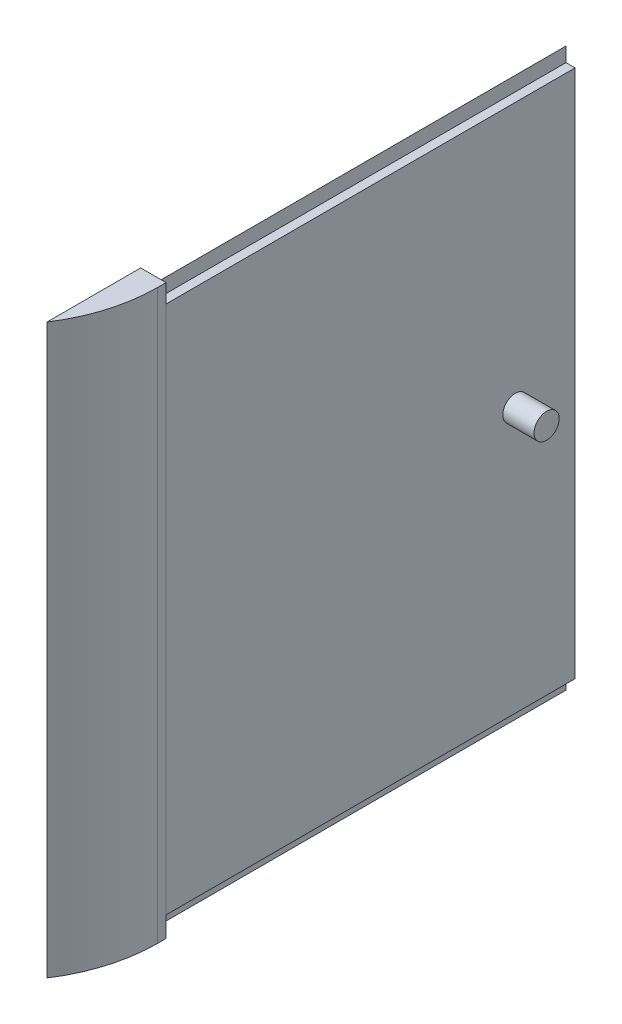
ISO-10303-21;
HEADER;
FILE_DESCRIPTION(('STEP AP214'),'2;1');
FILE_NAME('part.step','',(''),(''),'','','');
FILE_SCHEMA(('AUTOMOTIVE_DESIGN { 1 0 10303 214 1 1 1 1 }'));
ENDSEC;
DATA;
#1=APPLICATION_CONTEXT('core data for automotive mechanical design processes');
#2=APPLICATION_PROTOCOL_DEFINITION('international standard','automotive_design',2000,#1);
#3=PRODUCT_CONTEXT('',#1,'mechanical');
#4=PRODUCT('Part','Part','',(#3));
#5=PRODUCT_RELATED_PRODUCT_CATEGORY('part','',(#4));
#6=PRODUCT_DEFINITION_FORMATION('','',#4);
#7=PRODUCT_DEFINITION_CONTEXT('part definition',#1,'design');
#8=PRODUCT_DEFINITION('design','',#6,#7);
#9=PRODUCT_DEFINITION_SHAPE('','',#8);
#10=(LENGTH_UNIT() NAMED_UNIT(*) SI_UNIT(.MILLI.,.METRE.));
#11=(NAMED_UNIT(*) PLANE_ANGLE_UNIT() SI_UNIT($,.RADIAN.));
#12=(NAMED_UNIT(*) SI_UNIT($,.STERADIAN.) SOLID_ANGLE_UNIT());
#13=UNCERTAINTY_MEASURE_WITH_UNIT(LENGTH_MEASURE(1.E-05),#10,'distance_accuracy_value','');
#14=(GEOMETRIC_REPRESENTATION_CONTEXT(3) GLOBAL_UNCERTAINTY_ASSIGNED_CONTEXT((#13)) GLOBAL_UNIT_ASSIGNED_CONTEXT((#10,
#11,#12)) REPRESENTATION_CONTEXT('',''));
#15=CARTESIAN_POINT('',(0.,0.,0.));
#16=DIRECTION('',(0.,0.,1.));
#17=DIRECTION('',(1.,0.,0.));
#18=AXIS2_PLACEMENT_3D('',#15,#16,#17);
#19=CARTESIAN_POINT('',(37.6840725431511,-12.25,-105.));
#20=DIRECTION('',(0.,1.,0.));
#21=DIRECTION('',(0.,0.,1.));
#22=AXIS2_PLACEMENT_3D('',#19,#20,#21);
#23=PLANE('',#22);
#24=DIRECTION('',(-1.,0.,0.));
#25=VECTOR('',#24,1.);
#26=CARTESIAN_POINT('',(37.6840725431511,-12.25,0.));
#27=LINE('',#26,#25);
#28=CARTESIAN_POINT('',(39.75,-12.25,0.));
#29=VERTEX_POINT('',#28);
#30=CARTESIAN_POINT('',(37.4340725431511,-12.25,0.));
#31=VERTEX_POINT('',#30);
#32=EDGE_CURVE('E166',#29,#31,#27,.T.);
#33=ORIENTED_EDGE('',*,*,#32,.F.);
#34=DIRECTION('',(0.,0.,1.));
#35=VECTOR('',#34,1.);
#36=CARTESIAN_POINT('',(39.75,-12.25,-105.));
#37=LINE('',#36,#35);
#38=CARTESIAN_POINT('',(39.75,-12.25,-105.));
#39=VERTEX_POINT('',#38);
#40=EDGE_CURVE('E209',#39,#29,#37,.T.);
#41=ORIENTED_EDGE('',*,*,#40,.F.);
#42=DIRECTION('',(-1.,0.,0.));
#43=VECTOR('',#42,1.);
#44=CARTESIAN_POINT('',(37.6840725431511,-12.25,-105.));
#45=LINE('',#44,#43);
#46=CARTESIAN_POINT('',(37.4340725431511,-12.25,-105.));
#47=VERTEX_POINT('',#46);
#48=EDGE_CURVE('E182',#39,#47,#45,.T.);
#49=ORIENTED_EDGE('',*,*,#48,.T.);
#50=DIRECTION('',(0.,0.,1.));
#51=VECTOR('',#50,1.);
#52=CARTESIAN_POINT('',(37.4340725431511,-12.25,-105.));
#53=LINE('',#52,#51);
#54=EDGE_CURVE('E128',#47,#31,#53,.T.);
#55=ORIENTED_EDGE('',*,*,#54,.T.);
#56=EDGE_LOOP('',(#33,#41,#49,#55));
#57=FACE_BOUND('',#56,.T.);
#58=ADVANCED_FACE('F39',(#57),#23,.T.);
#59=CARTESIAN_POINT('',(39.75,-12.25,-105.));
#60=DIRECTION('',(1.,0.,0.));
#61=DIRECTION('',(0.,0.,-1.));
#62=AXIS2_PLACEMENT_3D('',#59,#60,#61);
#63=PLANE('',#62);
#64=CARTESIAN_POINT('',(39.75,-80.,-89.7147562589282));
#65=DIRECTION('',(1.,0.,0.));
#66=DIRECTION('',(0.,0.,-1.));
#67=AXIS2_PLACEMENT_3D('',#64,#65,#66);
#68=CIRCLE('',#67,3.21909799375135);
#69=CARTESIAN_POINT('',(39.75,-80.,-92.9338542526796));
#70=VERTEX_POINT('',#69);
#71=EDGE_CURVE('E152',#70,#70,#68,.T.);
#72=ORIENTED_EDGE('',*,*,#71,.F.);
#73=EDGE_LOOP('',(#72));
#74=FACE_BOUND('',#73,.T.);
#75=DIRECTION('',(0.,1.,0.));
#76=VECTOR('',#75,1.);
#77=CARTESIAN_POINT('',(39.75,-12.25,0.));
#78=LINE('',#77,#76);
#79=CARTESIAN_POINT('',(39.75,-147.75,0.));
#80=VERTEX_POINT('',#79);
#81=EDGE_CURVE('E202',#80,#29,#78,.T.);
#82=ORIENTED_EDGE('',*,*,#81,.F.);
#83=DIRECTION('',(0.,0.,1.));
#84=VECTOR('',#83,1.);
#85=CARTESIAN_POINT('',(39.75,-147.75,-105.));
#86=LINE('',#85,#84);
#87=CARTESIAN_POINT('',(39.75,-147.75,-105.));
#88=VERTEX_POINT('',#87);
#89=EDGE_CURVE('E211',#88,#80,#86,.T.);
#90=ORIENTED_EDGE('',*,*,#89,.F.);
#91=DIRECTION('',(0.,1.,0.));
#92=VECTOR('',#91,1.);
#93=CARTESIAN_POINT('',(39.75,-12.25,-105.));
#94=LINE('',#93,#92);
#95=EDGE_CURVE('E179',#88,#39,#94,.T.);
#96=ORIENTED_EDGE('',*,*,#95,.T.);
#97=ORIENTED_EDGE('',*,*,#40,.T.);
#98=EDGE_LOOP('',(#82,#90,#96,#97));
#99=FACE_BOUND('',#98,.T.);
#100=ADVANCED_FACE('F259',(#74,#99),#63,.T.);
#101=CARTESIAN_POINT('',(37.6840725431511,-147.75,-105.));
#102=DIRECTION('',(0.,-1.,0.));
#103=DIRECTION('',(0.,0.,-1.));
#104=AXIS2_PLACEMENT_3D('',#101,#102,#103);
#105=PLANE('',#104);
#106=DIRECTION('',(1.,0.,0.));
#107=VECTOR('',#106,1.);
#108=CARTESIAN_POINT('',(37.6840725431511,-147.75,0.));
#109=LINE('',#108,#107);
#110=CARTESIAN_POINT('',(37.4340725431511,-147.75,0.));
#111=VERTEX_POINT('',#110);
#112=EDGE_CURVE('E199',#111,#80,#109,.T.);
#113=ORIENTED_EDGE('',*,*,#112,.F.);
#114=DIRECTION('',(0.,0.,1.));
#115=VECTOR('',#114,1.);
#116=CARTESIAN_POINT('',(37.4340725431511,-147.75,-105.));
#117=LINE('',#116,#115);
#118=CARTESIAN_POINT('',(37.4340725431511,-147.75,-105.));
#119=VERTEX_POINT('',#118);
#120=EDGE_CURVE('E213',#119,#111,#117,.T.);
#121=ORIENTED_EDGE('',*,*,#120,.F.);
#122=DIRECTION('',(1.,0.,0.));
#123=VECTOR('',#122,1.);
#124=CARTESIAN_POINT('',(37.4340725431511,-147.75,-105.));
#125=LINE('',#124,#123);
#126=EDGE_CURVE('E177',#119,#88,#125,.T.);
#127=ORIENTED_EDGE('',*,*,#126,.T.);
#128=ORIENTED_EDGE('',*,*,#89,.T.);
#129=EDGE_LOOP('',(#113,#121,#127,#128));
#130=FACE_BOUND('',#129,.T.);
#131=ADVANCED_FACE('F257',(#130),#105,.T.);
#132=CARTESIAN_POINT('',(37.4340725431511,-148.,-105.));
#133=DIRECTION('',(1.,0.,0.));
#134=DIRECTION('',(0.,0.,-1.));
#135=AXIS2_PLACEMENT_3D('',#132,#133,#134);
#136=PLANE('',#135);
#137=DIRECTION('',(0.,1.,0.));
#138=VECTOR('',#137,1.);
#139=CARTESIAN_POINT('',(37.4340725431511,-148.,0.));
#140=LINE('',#139,#138);
#141=CARTESIAN_POINT('',(37.4340725431511,-151.441105038332,0.));
#142=VERTEX_POINT('',#141);
#143=EDGE_CURVE('E196',#142,#111,#140,.T.);
#144=ORIENTED_EDGE('',*,*,#143,.F.);
#145=DIRECTION('',(0.,0.,1.));
#146=VECTOR('',#145,1.);
#147=CARTESIAN_POINT('',(37.4340725431511,-151.441105038332,-105.));
#148=LINE('',#147,#146);
#149=CARTESIAN_POINT('',(37.4340725431511,-151.441105038332,-105.));
#150=VERTEX_POINT('',#149);
#151=EDGE_CURVE('E216',#150,#142,#148,.T.);
#152=ORIENTED_EDGE('',*,*,#151,.F.);
#153=DIRECTION('',(0.,1.,0.));
#154=VECTOR('',#153,1.);
#155=CARTESIAN_POINT('',(37.4340725431511,-151.441105038332,-105.));
#156=LINE('',#155,#154);
#157=EDGE_CURVE('E175',#150,#119,#156,.T.);
#158=ORIENTED_EDGE('',*,*,#157,.T.);
#159=ORIENTED_EDGE('',*,*,#120,.T.);
#160=EDGE_LOOP('',(#144,#152,#158,#159));
#161=FACE_BOUND('',#160,.T.);
#162=ADVANCED_FACE('F252',(#161),#136,.T.);
#163=CARTESIAN_POINT('',(33.9340725431511,-147.897355038332,-105.));
#164=DIRECTION('',(-0.711485024799433,-0.702701259061167,0.));
#165=DIRECTION('',(0.702701259061167,-0.711485024799434,0.));
#166=AXIS2_PLACEMENT_3D('',#163,#164,#165);
#167=PLANE('',#166);
#168=DIRECTION('',(0.702701259061167,-0.711485024799434,0.));
#169=VECTOR('',#168,1.);
#170=CARTESIAN_POINT('',(33.9340725431511,-147.897355038332,0.));
#171=LINE('',#170,#169);
#172=CARTESIAN_POINT('',(33.9340725431511,-147.897355038332,0.));
#173=VERTEX_POINT('',#172);
#174=EDGE_CURVE('E193',#173,#142,#171,.T.);
#175=ORIENTED_EDGE('',*,*,#174,.F.);
#176=DIRECTION('',(0.,0.,1.));
#177=VECTOR('',#176,1.);
#178=CARTESIAN_POINT('',(33.9340725431511,-147.897355038332,-105.));
#179=LINE('',#178,#177);
#180=CARTESIAN_POINT('',(33.9340725431511,-147.897355038332,-105.));
#181=VERTEX_POINT('',#180);
#182=EDGE_CURVE('E219',#181,#173,#179,.T.);
#183=ORIENTED_EDGE('',*,*,#182,.F.);
#184=DIRECTION('',(0.702701259061167,-0.711485024799434,0.));
#185=VECTOR('',#184,1.);
#186=CARTESIAN_POINT('',(33.9340725431511,-147.897355038332,-105.));
#187=LINE('',#186,#185);
#188=EDGE_CURVE('E172',#181,#150,#187,.T.);
#189=ORIENTED_EDGE('',*,*,#188,.T.);
#190=ORIENTED_EDGE('',*,*,#151,.T.);
#191=EDGE_LOOP('',(#175,#183,#189,#190));
#192=FACE_BOUND('',#191,.T.);
#193=ADVANCED_FACE('F250',(#192),#167,.T.);
#194=CARTESIAN_POINT('',(33.9340725431511,-12.1026449616677,-105.));
#195=DIRECTION('',(-1.,0.,0.));
#196=DIRECTION('',(0.,0.,1.));
#197=AXIS2_PLACEMENT_3D('',#194,#195,#196);
#198=PLANE('',#197);
#199=DIRECTION('',(0.,-1.,0.));
#200=VECTOR('',#199,1.);
#201=CARTESIAN_POINT('',(33.9340725431511,-12.1026449616677,0.));
#202=LINE('',#201,#200);
#203=CARTESIAN_POINT('',(33.9340725431511,-12.1026449616677,0.));
#204=VERTEX_POINT('',#203);
#205=EDGE_CURVE('E190',#204,#173,#202,.T.);
#206=ORIENTED_EDGE('',*,*,#205,.F.);
#207=DIRECTION('',(0.,0.,1.));
#208=VECTOR('',#207,1.);
#209=CARTESIAN_POINT('',(33.9340725431511,-12.1026449616677,-105.));
#210=LINE('',#209,#208);
#211=CARTESIAN_POINT('',(33.9340725431511,-12.1026449616677,-105.));
#212=VERTEX_POINT('',#211);
#213=EDGE_CURVE('E221',#212,#204,#210,.T.);
#214=ORIENTED_EDGE('',*,*,#213,.F.);
#215=DIRECTION('',(0.,-1.,0.));
#216=VECTOR('',#215,1.);
#217=CARTESIAN_POINT('',(33.9340725431511,-12.1026449616677,-105.));
#218=LINE('',#217,#216);
#219=EDGE_CURVE('E169',#212,#181,#218,.T.);
#220=ORIENTED_EDGE('',*,*,#219,.T.);
#221=ORIENTED_EDGE('',*,*,#182,.T.);
#222=EDGE_LOOP('',(#206,#214,#220,#221));
#223=FACE_BOUND('',#222,.T.);
#224=ADVANCED_FACE('F247',(#223),#198,.T.);
#225=CARTESIAN_POINT('',(37.4340725431511,-8.55889496166766,-105.));
#226=DIRECTION('',(-0.711485024799432,0.702701259061169,0.));
#227=DIRECTION('',(-0.702701259061169,-0.711485024799432,0.));
#228=AXIS2_PLACEMENT_3D('',#225,#226,#227);
#229=PLANE('',#228);
#230=DIRECTION('',(-0.702701259061169,-0.711485024799432,0.));
#231=VECTOR('',#230,1.);
#232=CARTESIAN_POINT('',(37.4340725431511,-8.55889496166766,0.));
#233=LINE('',#232,#231);
#234=CARTESIAN_POINT('',(37.4340725431511,-8.55889496166766,0.));
#235=VERTEX_POINT('',#234);
#236=EDGE_CURVE('E187',#235,#204,#233,.T.);
#237=ORIENTED_EDGE('',*,*,#236,.F.);
#238=DIRECTION('',(0.,0.,1.));
#239=VECTOR('',#238,1.);
#240=CARTESIAN_POINT('',(37.4340725431511,-8.55889496166766,-105.));
#241=LINE('',#240,#239);
#242=CARTESIAN_POINT('',(37.4340725431511,-8.55889496166766,-105.));
#243=VERTEX_POINT('',#242);
#244=EDGE_CURVE('E184',#243,#235,#241,.T.);
#245=ORIENTED_EDGE('',*,*,#244,.F.);
#246=DIRECTION('',(-0.702701259061169,-0.711485024799432,0.));
#247=VECTOR('',#246,1.);
#248=CARTESIAN_POINT('',(37.4340725431511,-8.55889496166766,-105.));
#249=LINE('',#248,#247);
#250=EDGE_CURVE('E165',#243,#212,#249,.T.);
#251=ORIENTED_EDGE('',*,*,#250,.T.);
#252=ORIENTED_EDGE('',*,*,#213,.T.);
#253=EDGE_LOOP('',(#237,#245,#251,#252));
#254=FACE_BOUND('',#253,.T.);
#255=ADVANCED_FACE('F231',(#254),#229,.T.);
#256=CARTESIAN_POINT('',(37.4340725431511,-12.,-105.));
#257=DIRECTION('',(1.,0.,0.));
#258=DIRECTION('',(0.,0.,-1.));
#259=AXIS2_PLACEMENT_3D('',#256,#257,#258);
#260=PLANE('',#259);
#261=DIRECTION('',(0.,1.,0.));
#262=VECTOR('',#261,1.);
#263=CARTESIAN_POINT('',(37.4340725431511,-12.,0.));
#264=LINE('',#263,#262);
#265=EDGE_CURVE('E162',#31,#235,#264,.T.);
#266=ORIENTED_EDGE('',*,*,#265,.F.);
#267=ORIENTED_EDGE('',*,*,#54,.F.);
#268=DIRECTION('',(0.,1.,0.));
#269=VECTOR('',#268,1.);
#270=CARTESIAN_POINT('',(37.4340725431511,-12.,-105.));
#271=LINE('',#270,#269);
#272=EDGE_CURVE('E163',#47,#243,#271,.T.);
#273=ORIENTED_EDGE('',*,*,#272,.T.);
#274=ORIENTED_EDGE('',*,*,#244,.T.);
#275=EDGE_LOOP('',(#266,#267,#273,#274));
#276=FACE_BOUND('',#275,.T.);
#277=ADVANCED_FACE('F226',(#276),#260,.T.);
#278=CARTESIAN_POINT('',(0.,0.,-105.));
#279=DIRECTION('',(0.,0.,-1.));
#280=DIRECTION('',(-1.,0.,0.));
#281=AXIS2_PLACEMENT_3D('',#278,#279,#280);
#282=PLANE('',#281);
#283=ORIENTED_EDGE('',*,*,#272,.F.);
#284=ORIENTED_EDGE('',*,*,#48,.F.);
#285=ORIENTED_EDGE('',*,*,#95,.F.);
#286=ORIENTED_EDGE('',*,*,#126,.F.);
#287=ORIENTED_EDGE('',*,*,#157,.F.);
#288=ORIENTED_EDGE('',*,*,#188,.F.);
#289=ORIENTED_EDGE('',*,*,#219,.F.);
#290=ORIENTED_EDGE('',*,*,#250,.F.);
#291=EDGE_LOOP('',(#283,#284,#285,#286,#287,#288,#289,#290));
#292=FACE_BOUND('',#291,.T.);
#293=ADVANCED_FACE('F241',(#292),#282,.T.);
#294=CARTESIAN_POINT('',(40.,-7.25000000000001,24.));
#295=DIRECTION('',(-1.,0.,0.));
#296=DIRECTION('',(0.,-1.,0.));
#297=AXIS2_PLACEMENT_3D('',#294,#295,#296);
#298=PLANE('',#297);
#299=DIRECTION('',(0.,0.,-1.));
#300=VECTOR('',#299,1.);
#301=CARTESIAN_POINT('',(40.,-7.25000000000001,24.));
#302=LINE('',#301,#300);
#303=CARTESIAN_POINT('',(40.,-7.25000000000001,2.14250700560562));
#304=VERTEX_POINT('',#303);
#305=CARTESIAN_POINT('',(40.,-7.25000000000001,0.));
#306=VERTEX_POINT('',#305);
#307=EDGE_CURVE('E137',#304,#306,#302,.T.);
#308=ORIENTED_EDGE('',*,*,#307,.F.);
#309=DIRECTION('',(0.,-1.,0.));
#310=VECTOR('',#309,1.);
#311=CARTESIAN_POINT('',(40.,-7.25000000000001,2.14250700560562));
#312=LINE('',#311,#310);
#313=CARTESIAN_POINT('',(40.,-152.75,2.14250700560562));
#314=VERTEX_POINT('',#313);
#315=EDGE_CURVE('E47',#304,#314,#312,.T.);
#316=ORIENTED_EDGE('',*,*,#315,.T.);
#317=DIRECTION('',(0.,0.,-1.));
#318=VECTOR('',#317,1.);
#319=CARTESIAN_POINT('',(40.,-152.75,24.));
#320=LINE('',#319,#318);
#321=CARTESIAN_POINT('',(40.,-152.75,0.));
#322=VERTEX_POINT('',#321);
#323=EDGE_CURVE('E143',#314,#322,#320,.T.);
#324=ORIENTED_EDGE('',*,*,#323,.T.);
#325=DIRECTION('',(0.,1.,0.));
#326=VECTOR('',#325,1.);
#327=CARTESIAN_POINT('',(40.,-7.25000000000001,0.));
#328=LINE('',#327,#326);
#329=EDGE_CURVE('E154',#322,#306,#328,.T.);
#330=ORIENTED_EDGE('',*,*,#329,.T.);
#331=EDGE_LOOP('',(#308,#316,#324,#330));
#332=FACE_BOUND('',#331,.T.);
#333=ADVANCED_FACE('F283',(#332),#298,.F.);
#334=CARTESIAN_POINT('',(40.,-7.25000000000001,24.));
#335=DIRECTION('',(0.,-1.,0.));
#336=DIRECTION('',(1.,0.,0.));
#337=AXIS2_PLACEMENT_3D('',#334,#335,#336);
#338=PLANE('',#337);
#339=DIRECTION('',(0.,0.,-1.));
#340=VECTOR('',#339,1.);
#341=CARTESIAN_POINT('',(33.5,-7.25000000000001,24.));
#342=LINE('',#341,#340);
#343=CARTESIAN_POINT('',(33.5,-7.25000000000001,24.));
#344=VERTEX_POINT('',#343);
#345=CARTESIAN_POINT('',(33.5,-7.25000000000001,0.));
#346=VERTEX_POINT('',#345);
#347=EDGE_CURVE('E131',#344,#346,#342,.T.);
#348=ORIENTED_EDGE('',*,*,#347,.F.);
#349=CARTESIAN_POINT('',(0.,-7.25000000000001,2.14250700560562));
#350=DIRECTION('',(0.,-1.,0.));
#351=DIRECTION('',(1.,0.,0.));
#352=AXIS2_PLACEMENT_3D('',#349,#350,#351);
#353=CIRCLE('',#352,40.);
#354=EDGE_CURVE('E61',#344,#304,#353,.F.);
#355=ORIENTED_EDGE('',*,*,#354,.T.);
#356=ORIENTED_EDGE('',*,*,#307,.T.);
#357=DIRECTION('',(-1.,0.,0.));
#358=VECTOR('',#357,1.);
#359=CARTESIAN_POINT('',(40.,-7.25000000000001,0.));
#360=LINE('',#359,#358);
#361=EDGE_CURVE('E134',#306,#346,#360,.T.);
#362=ORIENTED_EDGE('',*,*,#361,.T.);
#363=EDGE_LOOP('',(#348,#355,#356,#362));
#364=FACE_BOUND('',#363,.T.);
#365=ADVANCED_FACE('F132',(#364),#338,.F.);
#366=CARTESIAN_POINT('',(33.5,-152.75,24.));
#367=DIRECTION('',(1.,0.,0.));
#368=DIRECTION('',(0.,1.,0.));
#369=AXIS2_PLACEMENT_3D('',#366,#367,#368);
#370=PLANE('',#369);
#371=DIRECTION('',(0.,-1.,0.));
#372=VECTOR('',#371,1.);
#373=CARTESIAN_POINT('',(33.5,-152.75,0.));
#374=LINE('',#373,#372);
#375=CARTESIAN_POINT('',(33.5,-152.75,0.));
#376=VERTEX_POINT('',#375);
#377=EDGE_CURVE('E148',#346,#376,#374,.T.);
#378=ORIENTED_EDGE('',*,*,#377,.T.);
#379=DIRECTION('',(0.,0.,-1.));
#380=VECTOR('',#379,1.);
#381=CARTESIAN_POINT('',(33.5,-152.75,24.));
#382=LINE('',#381,#380);
#383=CARTESIAN_POINT('',(33.5,-152.75,24.));
#384=VERTEX_POINT('',#383);
#385=EDGE_CURVE('E138',#384,#376,#382,.T.);
#386=ORIENTED_EDGE('',*,*,#385,.F.);
#387=DIRECTION('',(0.,-1.,0.));
#388=VECTOR('',#387,1.);
#389=CARTESIAN_POINT('',(33.5,-152.75,24.));
#390=LINE('',#389,#388);
#391=EDGE_CURVE('E127',#344,#384,#390,.T.);
#392=ORIENTED_EDGE('',*,*,#391,.F.);
#393=ORIENTED_EDGE('',*,*,#347,.T.);
#394=EDGE_LOOP('',(#378,#386,#392,#393));
#395=FACE_BOUND('',#394,.T.);
#396=ADVANCED_FACE('F141',(#395),#370,.F.);
#397=CARTESIAN_POINT('',(40.,-152.75,24.));
#398=DIRECTION('',(0.,1.,0.));
#399=DIRECTION('',(0.,0.,1.));
#400=AXIS2_PLACEMENT_3D('',#397,#398,#399);
#401=PLANE('',#400);
#402=ORIENTED_EDGE('',*,*,#323,.F.);
#403=CARTESIAN_POINT('',(0.,-152.75,2.14250700560562));
#404=DIRECTION('',(0.,1.,0.));
#405=DIRECTION('',(0.,0.,1.));
#406=AXIS2_PLACEMENT_3D('',#403,#404,#405);
#407=CIRCLE('',#406,40.);
#408=EDGE_CURVE('E11',#314,#384,#407,.F.);
#409=ORIENTED_EDGE('',*,*,#408,.T.);
#410=ORIENTED_EDGE('',*,*,#385,.T.);
#411=DIRECTION('',(1.,0.,0.));
#412=VECTOR('',#411,1.);
#413=CARTESIAN_POINT('',(40.,-152.75,0.));
#414=LINE('',#413,#412);
#415=EDGE_CURVE('E144',#376,#322,#414,.T.);
#416=ORIENTED_EDGE('',*,*,#415,.T.);
#417=EDGE_LOOP('',(#402,#409,#410,#416));
#418=FACE_BOUND('',#417,.T.);
#419=ADVANCED_FACE('F293',(#418),#401,.F.);
#420=CARTESIAN_POINT('',(0.,0.,0.));
#421=DIRECTION('',(0.,0.,-1.));
#422=DIRECTION('',(-1.,0.,0.));
#423=AXIS2_PLACEMENT_3D('',#420,#421,#422);
#424=PLANE('',#423);
#425=ORIENTED_EDGE('',*,*,#81,.T.);
#426=ORIENTED_EDGE('',*,*,#32,.T.);
#427=ORIENTED_EDGE('',*,*,#265,.T.);
#428=ORIENTED_EDGE('',*,*,#236,.T.);
#429=ORIENTED_EDGE('',*,*,#205,.T.);
#430=ORIENTED_EDGE('',*,*,#174,.T.);
#431=ORIENTED_EDGE('',*,*,#143,.T.);
#432=ORIENTED_EDGE('',*,*,#112,.T.);
#433=EDGE_LOOP('',(#425,#426,#427,#428,#429,#430,#431,#432));
#434=FACE_BOUND('',#433,.T.);
#435=ORIENTED_EDGE('',*,*,#329,.F.);
#436=ORIENTED_EDGE('',*,*,#415,.F.);
#437=ORIENTED_EDGE('',*,*,#377,.F.);
#438=ORIENTED_EDGE('',*,*,#361,.F.);
#439=EDGE_LOOP('',(#435,#436,#437,#438));
#440=FACE_BOUND('',#439,.T.);
#441=ADVANCED_FACE('F234',(#434,#440),#424,.T.);
#442=CARTESIAN_POINT('',(0.,0.,2.14250700560562));
#443=DIRECTION('',(0.,-1.,0.));
#444=DIRECTION('',(1.,0.,0.));
#445=AXIS2_PLACEMENT_3D('',#442,#443,#444);
#446=CYLINDRICAL_SURFACE('',#445,40.);
#447=ORIENTED_EDGE('',*,*,#408,.F.);
#448=ORIENTED_EDGE('',*,*,#315,.F.);
#449=ORIENTED_EDGE('',*,*,#354,.F.);
#450=ORIENTED_EDGE('',*,*,#391,.T.);
#451=EDGE_LOOP('',(#447,#448,#449,#450));
#452=FACE_BOUND('',#451,.T.);
#453=ADVANCED_FACE('F41',(#452),#446,.T.);
#454=CARTESIAN_POINT('',(47.75,-80.,-89.7147562589282));
#455=DIRECTION('',(-1.,0.,0.));
#456=DIRECTION('',(0.,0.,1.));
#457=AXIS2_PLACEMENT_3D('',#454,#455,#456);
#458=CYLINDRICAL_SURFACE('',#457,3.21909799375135);
#459=CARTESIAN_POINT('',(47.75,-80.,-89.7147562589282));
#460=DIRECTION('',(1.,0.,0.));
#461=DIRECTION('',(0.,0.,-1.));
#462=AXIS2_PLACEMENT_3D('',#459,#460,#461);
#463=CIRCLE('',#462,3.21909799375135);
#464=CARTESIAN_POINT('',(47.75,-80.,-92.9338542526796));
#465=VERTEX_POINT('',#464);
#466=EDGE_CURVE('E157',#465,#465,#463,.T.);
#467=ORIENTED_EDGE('',*,*,#466,.F.);
#468=EDGE_LOOP('',(#467));
#469=FACE_BOUND('',#468,.T.);
#470=ORIENTED_EDGE('',*,*,#71,.T.);
#471=EDGE_LOOP('',(#470));
#472=FACE_BOUND('',#471,.T.);
#473=ADVANCED_FACE('F299',(#469,#472),#458,.T.);
#474=CARTESIAN_POINT('',(47.75,-80.,-89.7147562589282));
#475=DIRECTION('',(1.,0.,0.));
#476=DIRECTION('',(0.,0.,-1.));
#477=AXIS2_PLACEMENT_3D('',#474,#475,#476);
#478=PLANE('',#477);
#479=ORIENTED_EDGE('',*,*,#466,.T.);
#480=EDGE_LOOP('',(#479));
#481=FACE_BOUND('',#480,.T.);
#482=ADVANCED_FACE('F302',(#481),#478,.T.);
#483=CLOSED_SHELL('',(#58,#100,#131,#162,#193,#224,#255,#277,#293,#333,#365,#396,#419,#441,#453,
#473,#482));
#484=MANIFOLD_SOLID_BREP('B2',#483);
#485=ADVANCED_BREP_SHAPE_REPRESENTATION('',(#18,#484),#14);
#486=SHAPE_DEFINITION_REPRESENTATION(#9,#485);
ENDSEC;
END-ISO-10303-21;
